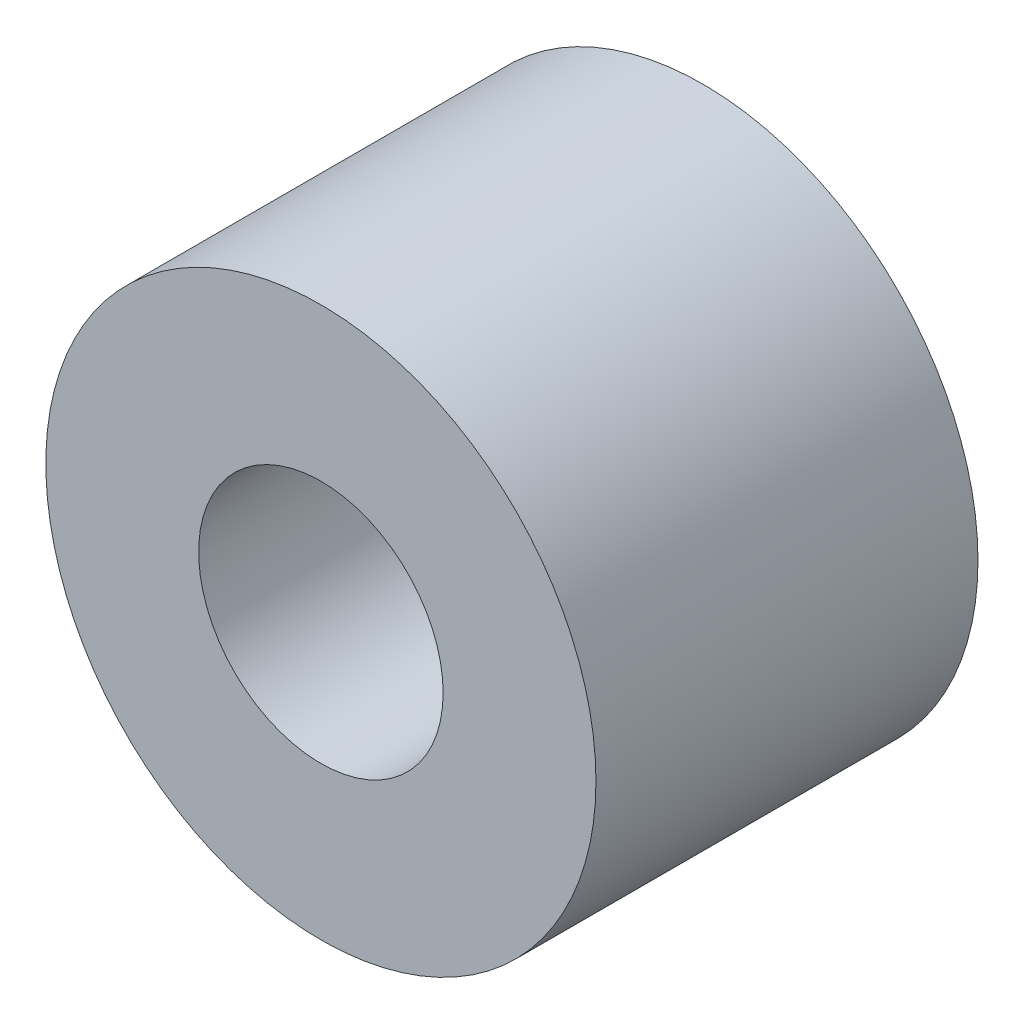
ISO-10303-21;
HEADER;
FILE_DESCRIPTION(('STEP AP214'),'2;1');
FILE_NAME('part.step','',(''),(''),'','','');
FILE_SCHEMA(('AUTOMOTIVE_DESIGN { 1 0 10303 214 1 1 1 1 }'));
ENDSEC;
DATA;
#1=APPLICATION_CONTEXT('core data for automotive mechanical design processes');
#2=APPLICATION_PROTOCOL_DEFINITION('international standard','automotive_design',2000,#1);
#3=PRODUCT_CONTEXT('',#1,'mechanical');
#4=PRODUCT('Part','Part','',(#3));
#5=PRODUCT_RELATED_PRODUCT_CATEGORY('part','',(#4));
#6=PRODUCT_DEFINITION_FORMATION('','',#4);
#7=PRODUCT_DEFINITION_CONTEXT('part definition',#1,'design');
#8=PRODUCT_DEFINITION('design','',#6,#7);
#9=PRODUCT_DEFINITION_SHAPE('','',#8);
#10=(LENGTH_UNIT() NAMED_UNIT(*) SI_UNIT(.MILLI.,.METRE.));
#11=(NAMED_UNIT(*) PLANE_ANGLE_UNIT() SI_UNIT($,.RADIAN.));
#12=(NAMED_UNIT(*) SI_UNIT($,.STERADIAN.) SOLID_ANGLE_UNIT());
#13=UNCERTAINTY_MEASURE_WITH_UNIT(LENGTH_MEASURE(1.E-05),#10,'distance_accuracy_value','');
#14=(GEOMETRIC_REPRESENTATION_CONTEXT(3) GLOBAL_UNCERTAINTY_ASSIGNED_CONTEXT((#13)) GLOBAL_UNIT_ASSIGNED_CONTEXT((#10,
#11,#12)) REPRESENTATION_CONTEXT('',''));
#15=CARTESIAN_POINT('',(0.,0.,0.));
#16=DIRECTION('',(0.,0.,1.));
#17=DIRECTION('',(1.,0.,0.));
#18=AXIS2_PLACEMENT_3D('',#15,#16,#17);
#19=CARTESIAN_POINT('',(0.,0.,5.));
#20=DIRECTION('',(0.,0.,1.));
#21=DIRECTION('',(1.,0.,0.));
#22=AXIS2_PLACEMENT_3D('',#19,#20,#21);
#23=PLANE('',#22);
#24=CARTESIAN_POINT('',(0.,0.,5.));
#25=DIRECTION('',(0.,0.,1.));
#26=DIRECTION('',(1.,0.,0.));
#27=AXIS2_PLACEMENT_3D('',#24,#25,#26);
#28=CIRCLE('',#27,3.6);
#29=CARTESIAN_POINT('',(3.6,0.,5.));
#30=VERTEX_POINT('',#29);
#31=EDGE_CURVE('E10',#30,#30,#28,.T.);
#32=ORIENTED_EDGE('',*,*,#31,.T.);
#33=EDGE_LOOP('',(#32));
#34=FACE_BOUND('',#33,.T.);
#35=CARTESIAN_POINT('',(0.,0.,5.));
#36=DIRECTION('',(0.,0.,1.));
#37=DIRECTION('',(1.,0.,0.));
#38=AXIS2_PLACEMENT_3D('',#35,#36,#37);
#39=CIRCLE('',#38,1.6);
#40=CARTESIAN_POINT('',(1.6,0.,5.));
#41=VERTEX_POINT('',#40);
#42=EDGE_CURVE('E42',#41,#41,#39,.T.);
#43=ORIENTED_EDGE('',*,*,#42,.F.);
#44=EDGE_LOOP('',(#43));
#45=FACE_BOUND('',#44,.T.);
#46=ADVANCED_FACE('F31',(#34,#45),#23,.T.);
#47=CARTESIAN_POINT('',(0.,0.,0.));
#48=DIRECTION('',(0.,0.,1.));
#49=DIRECTION('',(1.,0.,0.));
#50=AXIS2_PLACEMENT_3D('',#47,#48,#49);
#51=PLANE('',#50);
#52=CARTESIAN_POINT('',(0.,0.,0.));
#53=DIRECTION('',(0.,0.,1.));
#54=DIRECTION('',(1.,0.,0.));
#55=AXIS2_PLACEMENT_3D('',#52,#53,#54);
#56=CIRCLE('',#55,3.6);
#57=CARTESIAN_POINT('',(3.6,0.,0.));
#58=VERTEX_POINT('',#57);
#59=EDGE_CURVE('E35',#58,#58,#56,.T.);
#60=ORIENTED_EDGE('',*,*,#59,.F.);
#61=EDGE_LOOP('',(#60));
#62=FACE_BOUND('',#61,.T.);
#63=CARTESIAN_POINT('',(0.,0.,0.));
#64=DIRECTION('',(0.,0.,1.));
#65=DIRECTION('',(1.,0.,0.));
#66=AXIS2_PLACEMENT_3D('',#63,#64,#65);
#67=CIRCLE('',#66,1.6);
#68=CARTESIAN_POINT('',(1.6,0.,0.));
#69=VERTEX_POINT('',#68);
#70=EDGE_CURVE('E44',#69,#69,#67,.T.);
#71=ORIENTED_EDGE('',*,*,#70,.T.);
#72=EDGE_LOOP('',(#71));
#73=FACE_BOUND('',#72,.T.);
#74=ADVANCED_FACE('F54',(#62,#73),#51,.F.);
#75=CARTESIAN_POINT('',(0.,0.,5.));
#76=DIRECTION('',(0.,0.,-1.));
#77=DIRECTION('',(-1.,0.,0.));
#78=AXIS2_PLACEMENT_3D('',#75,#76,#77);
#79=CYLINDRICAL_SURFACE('',#78,3.6);
#80=ORIENTED_EDGE('',*,*,#31,.F.);
#81=EDGE_LOOP('',(#80));
#82=FACE_BOUND('',#81,.T.);
#83=ORIENTED_EDGE('',*,*,#59,.T.);
#84=EDGE_LOOP('',(#83));
#85=FACE_BOUND('',#84,.T.);
#86=ADVANCED_FACE('F33',(#82,#85),#79,.T.);
#87=CARTESIAN_POINT('',(0.,0.,5.));
#88=DIRECTION('',(0.,0.,-1.));
#89=DIRECTION('',(-1.,0.,0.));
#90=AXIS2_PLACEMENT_3D('',#87,#88,#89);
#91=CYLINDRICAL_SURFACE('',#90,1.6);
#92=ORIENTED_EDGE('',*,*,#42,.T.);
#93=EDGE_LOOP('',(#92));
#94=FACE_BOUND('',#93,.T.);
#95=ORIENTED_EDGE('',*,*,#70,.F.);
#96=EDGE_LOOP('',(#95));
#97=FACE_BOUND('',#96,.T.);
#98=ADVANCED_FACE('F50',(#94,#97),#91,.F.);
#99=CLOSED_SHELL('',(#46,#74,#86,#98));
#100=MANIFOLD_SOLID_BREP('B2',#99);
#101=ADVANCED_BREP_SHAPE_REPRESENTATION('',(#18,#100),#14);
#102=SHAPE_DEFINITION_REPRESENTATION(#9,#101);
ENDSEC;
END-ISO-10303-21;
